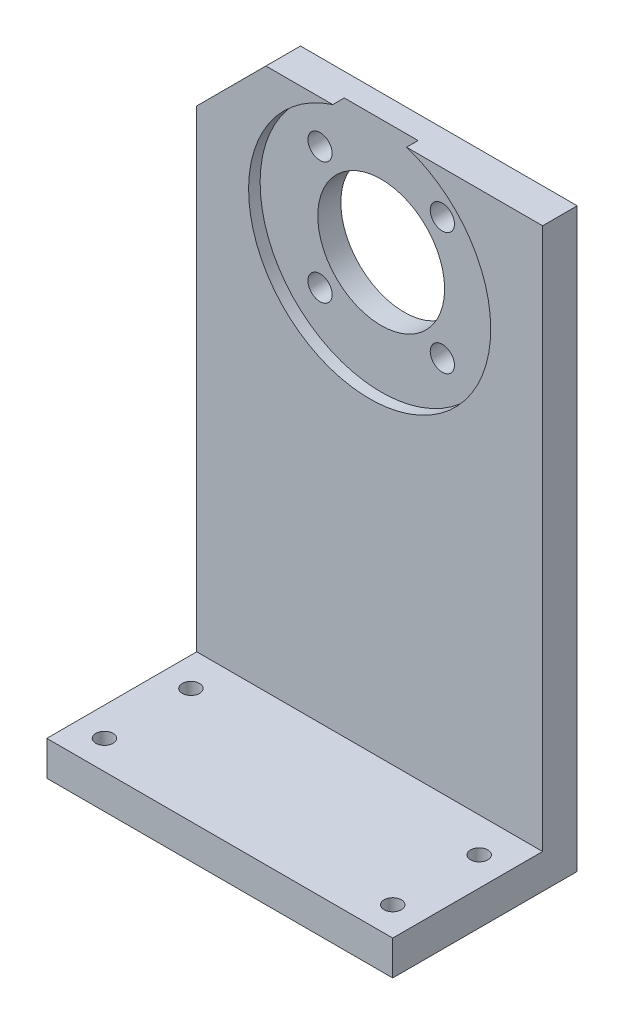
ISO-10303-21;
HEADER;
FILE_DESCRIPTION(('STEP AP214'),'2;1');
FILE_NAME('part.step','',(''),(''),'','','');
FILE_SCHEMA(('AUTOMOTIVE_DESIGN { 1 0 10303 214 1 1 1 1 }'));
ENDSEC;
DATA;
#1=APPLICATION_CONTEXT('core data for automotive mechanical design processes');
#2=APPLICATION_PROTOCOL_DEFINITION('international standard','automotive_design',2000,#1);
#3=PRODUCT_CONTEXT('',#1,'mechanical');
#4=PRODUCT('Part','Part','',(#3));
#5=PRODUCT_RELATED_PRODUCT_CATEGORY('part','',(#4));
#6=PRODUCT_DEFINITION_FORMATION('','',#4);
#7=PRODUCT_DEFINITION_CONTEXT('part definition',#1,'design');
#8=PRODUCT_DEFINITION('design','',#6,#7);
#9=PRODUCT_DEFINITION_SHAPE('','',#8);
#10=(LENGTH_UNIT() NAMED_UNIT(*) SI_UNIT(.MILLI.,.METRE.));
#11=(NAMED_UNIT(*) PLANE_ANGLE_UNIT() SI_UNIT($,.RADIAN.));
#12=(NAMED_UNIT(*) SI_UNIT($,.STERADIAN.) SOLID_ANGLE_UNIT());
#13=UNCERTAINTY_MEASURE_WITH_UNIT(LENGTH_MEASURE(1.E-05),#10,'distance_accuracy_value','');
#14=(GEOMETRIC_REPRESENTATION_CONTEXT(3) GLOBAL_UNCERTAINTY_ASSIGNED_CONTEXT((#13)) GLOBAL_UNIT_ASSIGNED_CONTEXT((#10,
#11,#12)) REPRESENTATION_CONTEXT('',''));
#15=CARTESIAN_POINT('',(0.,0.,0.));
#16=DIRECTION('',(0.,0.,1.));
#17=DIRECTION('',(1.,0.,0.));
#18=AXIS2_PLACEMENT_3D('',#15,#16,#17);
#19=CARTESIAN_POINT('',(211.2030482675,-297.147680018,50.));
#20=DIRECTION('',(0.,1.,0.));
#21=DIRECTION('',(0.,0.,1.));
#22=AXIS2_PLACEMENT_3D('',#19,#20,#21);
#23=CYLINDRICAL_SURFACE('',#22,1.50000000000003);
#24=CARTESIAN_POINT('',(211.2030482675,-292.147680018,50.));
#25=DIRECTION('',(0.,1.,0.));
#26=DIRECTION('',(0.,0.,1.));
#27=AXIS2_PLACEMENT_3D('',#24,#25,#26);
#28=CIRCLE('',#27,1.50000000000003);
#29=CARTESIAN_POINT('',(211.2030482675,-292.147680018,51.5));
#30=VERTEX_POINT('',#29);
#31=EDGE_CURVE('E206',#30,#30,#28,.T.);
#32=ORIENTED_EDGE('',*,*,#31,.F.);
#33=EDGE_LOOP('',(#32));
#34=FACE_BOUND('',#33,.T.);
#35=CARTESIAN_POINT('',(211.2030482675,-286.147680018,50.));
#36=DIRECTION('',(0.,1.,0.));
#37=DIRECTION('',(0.,0.,1.));
#38=AXIS2_PLACEMENT_3D('',#35,#36,#37);
#39=CIRCLE('',#38,1.50000000000003);
#40=CARTESIAN_POINT('',(211.2030482675,-286.147680018,51.5));
#41=VERTEX_POINT('',#40);
#42=EDGE_CURVE('E161',#41,#41,#39,.F.);
#43=ORIENTED_EDGE('',*,*,#42,.F.);
#44=EDGE_LOOP('',(#43));
#45=FACE_BOUND('',#44,.T.);
#46=ADVANCED_FACE('F17',(#34,#45),#23,.F.);
#47=CARTESIAN_POINT('',(211.2030482675,-297.147680018,35.));
#48=DIRECTION('',(0.,1.,0.));
#49=DIRECTION('',(0.,0.,1.));
#50=AXIS2_PLACEMENT_3D('',#47,#48,#49);
#51=CYLINDRICAL_SURFACE('',#50,1.50000000000003);
#52=CARTESIAN_POINT('',(211.2030482675,-292.147680018,35.));
#53=DIRECTION('',(0.,1.,0.));
#54=DIRECTION('',(0.,0.,1.));
#55=AXIS2_PLACEMENT_3D('',#52,#53,#54);
#56=CIRCLE('',#55,1.50000000000003);
#57=CARTESIAN_POINT('',(211.2030482675,-292.147680018,36.5));
#58=VERTEX_POINT('',#57);
#59=EDGE_CURVE('E203',#58,#58,#56,.T.);
#60=ORIENTED_EDGE('',*,*,#59,.F.);
#61=EDGE_LOOP('',(#60));
#62=FACE_BOUND('',#61,.T.);
#63=CARTESIAN_POINT('',(211.2030482675,-286.147680018,35.));
#64=DIRECTION('',(0.,1.,0.));
#65=DIRECTION('',(0.,0.,1.));
#66=AXIS2_PLACEMENT_3D('',#63,#64,#65);
#67=CIRCLE('',#66,1.50000000000003);
#68=CARTESIAN_POINT('',(211.2030482675,-286.147680018,36.5));
#69=VERTEX_POINT('',#68);
#70=EDGE_CURVE('E230',#69,#69,#67,.F.);
#71=ORIENTED_EDGE('',*,*,#70,.F.);
#72=EDGE_LOOP('',(#71));
#73=FACE_BOUND('',#72,.T.);
#74=ADVANCED_FACE('F248',(#62,#73),#51,.F.);
#75=CARTESIAN_POINT('',(261.2030482675,-297.147680018,35.));
#76=DIRECTION('',(0.,1.,0.));
#77=DIRECTION('',(0.,0.,1.));
#78=AXIS2_PLACEMENT_3D('',#75,#76,#77);
#79=CYLINDRICAL_SURFACE('',#78,1.50000000000002);
#80=CARTESIAN_POINT('',(261.2030482675,-292.147680018,35.));
#81=DIRECTION('',(0.,1.,0.));
#82=DIRECTION('',(0.,0.,1.));
#83=AXIS2_PLACEMENT_3D('',#80,#81,#82);
#84=CIRCLE('',#83,1.50000000000002);
#85=CARTESIAN_POINT('',(261.2030482675,-292.147680018,36.5));
#86=VERTEX_POINT('',#85);
#87=EDGE_CURVE('E200',#86,#86,#84,.T.);
#88=ORIENTED_EDGE('',*,*,#87,.F.);
#89=EDGE_LOOP('',(#88));
#90=FACE_BOUND('',#89,.T.);
#91=CARTESIAN_POINT('',(261.2030482675,-286.147680018,35.));
#92=DIRECTION('',(0.,1.,0.));
#93=DIRECTION('',(0.,0.,1.));
#94=AXIS2_PLACEMENT_3D('',#91,#92,#93);
#95=CIRCLE('',#94,1.50000000000002);
#96=CARTESIAN_POINT('',(261.2030482675,-286.147680018,36.5));
#97=VERTEX_POINT('',#96);
#98=EDGE_CURVE('E227',#97,#97,#95,.F.);
#99=ORIENTED_EDGE('',*,*,#98,.F.);
#100=EDGE_LOOP('',(#99));
#101=FACE_BOUND('',#100,.T.);
#102=ADVANCED_FACE('F239',(#90,#101),#79,.F.);
#103=CARTESIAN_POINT('',(261.2030482675,-297.147680018,50.));
#104=DIRECTION('',(0.,1.,0.));
#105=DIRECTION('',(0.,0.,1.));
#106=AXIS2_PLACEMENT_3D('',#103,#104,#105);
#107=CYLINDRICAL_SURFACE('',#106,1.50000000000002);
#108=CARTESIAN_POINT('',(261.2030482675,-292.147680018,50.));
#109=DIRECTION('',(0.,1.,0.));
#110=DIRECTION('',(0.,0.,1.));
#111=AXIS2_PLACEMENT_3D('',#108,#109,#110);
#112=CIRCLE('',#111,1.50000000000002);
#113=CARTESIAN_POINT('',(261.2030482675,-292.147680018,51.5));
#114=VERTEX_POINT('',#113);
#115=EDGE_CURVE('E197',#114,#114,#112,.T.);
#116=ORIENTED_EDGE('',*,*,#115,.F.);
#117=EDGE_LOOP('',(#116));
#118=FACE_BOUND('',#117,.T.);
#119=CARTESIAN_POINT('',(261.2030482675,-286.147680018,50.));
#120=DIRECTION('',(0.,1.,0.));
#121=DIRECTION('',(0.,0.,1.));
#122=AXIS2_PLACEMENT_3D('',#119,#120,#121);
#123=CIRCLE('',#122,1.50000000000002);
#124=CARTESIAN_POINT('',(261.2030482675,-286.147680018,51.5));
#125=VERTEX_POINT('',#124);
#126=EDGE_CURVE('E92',#125,#125,#123,.F.);
#127=ORIENTED_EDGE('',*,*,#126,.F.);
#128=EDGE_LOOP('',(#127));
#129=FACE_BOUND('',#128,.T.);
#130=ADVANCED_FACE('F237',(#118,#129),#107,.F.);
#131=CARTESIAN_POINT('',(236.203136991092,-212.147680018,27.));
#132=DIRECTION('',(0.,0.,1.));
#133=DIRECTION('',(1.,0.,0.));
#134=AXIS2_PLACEMENT_3D('',#131,#132,#133);
#135=CYLINDRICAL_SURFACE('',#134,21.);
#136=CARTESIAN_POINT('',(236.203136991092,-212.147680018,27.));
#137=DIRECTION('',(0.,0.,1.));
#138=DIRECTION('',(1.,0.,0.));
#139=AXIS2_PLACEMENT_3D('',#136,#137,#138);
#140=CIRCLE('',#139,21.);
#141=CARTESIAN_POINT('',(229.800012753659,-192.147680018,27.));
#142=VERTEX_POINT('',#141);
#143=CARTESIAN_POINT('',(242.606261228525,-192.147680018,27.));
#144=VERTEX_POINT('',#143);
#145=EDGE_CURVE('E20',#142,#144,#140,.T.);
#146=ORIENTED_EDGE('',*,*,#145,.F.);
#147=DIRECTION('',(0.,0.,-1.));
#148=VECTOR('',#147,1.);
#149=CARTESIAN_POINT('',(229.800012753659,-192.147680018,18.));
#150=LINE('',#149,#148);
#151=CARTESIAN_POINT('',(229.800012753659,-192.147680018,29.));
#152=VERTEX_POINT('',#151);
#153=EDGE_CURVE('E100',#142,#152,#150,.F.);
#154=ORIENTED_EDGE('',*,*,#153,.T.);
#155=CARTESIAN_POINT('',(236.203136991092,-212.147680018,29.));
#156=DIRECTION('',(0.,0.,1.));
#157=DIRECTION('',(1.,0.,0.));
#158=AXIS2_PLACEMENT_3D('',#155,#156,#157);
#159=CIRCLE('',#158,21.);
#160=CARTESIAN_POINT('',(242.606261228525,-192.147680018,29.));
#161=VERTEX_POINT('',#160);
#162=EDGE_CURVE('E104',#161,#152,#159,.F.);
#163=ORIENTED_EDGE('',*,*,#162,.F.);
#164=DIRECTION('',(0.,0.,-1.));
#165=VECTOR('',#164,1.);
#166=CARTESIAN_POINT('',(242.606261228525,-192.147680018,18.));
#167=LINE('',#166,#165);
#168=EDGE_CURVE('E97',#161,#144,#167,.T.);
#169=ORIENTED_EDGE('',*,*,#168,.T.);
#170=EDGE_LOOP('',(#146,#154,#163,#169));
#171=FACE_BOUND('',#170,.T.);
#172=ADVANCED_FACE('F103',(#171),#135,.F.);
#173=CARTESIAN_POINT('',(236.203136991092,-212.147680018,27.));
#174=DIRECTION('',(0.,0.,1.));
#175=DIRECTION('',(1.,0.,0.));
#176=AXIS2_PLACEMENT_3D('',#173,#174,#175);
#177=PLANE('',#176);
#178=CARTESIAN_POINT('',(236.203136991092,-212.147680018,27.));
#179=DIRECTION('',(0.,0.,1.));
#180=DIRECTION('',(1.,0.,0.));
#181=AXIS2_PLACEMENT_3D('',#178,#179,#180);
#182=CIRCLE('',#181,11.);
#183=CARTESIAN_POINT('',(247.203136991092,-212.147680018,27.));
#184=VERTEX_POINT('',#183);
#185=EDGE_CURVE('E209',#184,#184,#182,.F.);
#186=ORIENTED_EDGE('',*,*,#185,.T.);
#187=EDGE_LOOP('',(#186));
#188=FACE_BOUND('',#187,.T.);
#189=CARTESIAN_POINT('',(246.809738708891,-222.754281735798,27.));
#190=DIRECTION('',(0.,0.,-1.));
#191=DIRECTION('',(-1.,0.,0.));
#192=AXIS2_PLACEMENT_3D('',#189,#190,#191);
#193=CIRCLE('',#192,2.09999999999999);
#194=CARTESIAN_POINT('',(244.709738708891,-222.754281735798,27.));
#195=VERTEX_POINT('',#194);
#196=EDGE_CURVE('E212',#195,#195,#193,.T.);
#197=ORIENTED_EDGE('',*,*,#196,.T.);
#198=EDGE_LOOP('',(#197));
#199=FACE_BOUND('',#198,.T.);
#200=CARTESIAN_POINT('',(225.596535273294,-201.541078300202,27.));
#201=DIRECTION('',(0.,0.,-1.));
#202=DIRECTION('',(-1.,0.,0.));
#203=AXIS2_PLACEMENT_3D('',#200,#201,#202);
#204=CIRCLE('',#203,2.09999999999999);
#205=CARTESIAN_POINT('',(223.496535273294,-201.541078300202,27.));
#206=VERTEX_POINT('',#205);
#207=EDGE_CURVE('E218',#206,#206,#204,.T.);
#208=ORIENTED_EDGE('',*,*,#207,.T.);
#209=EDGE_LOOP('',(#208));
#210=FACE_BOUND('',#209,.T.);
#211=CARTESIAN_POINT('',(225.596535273294,-222.754281735798,27.));
#212=DIRECTION('',(0.,0.,-1.));
#213=DIRECTION('',(-1.,0.,0.));
#214=AXIS2_PLACEMENT_3D('',#211,#212,#213);
#215=CIRCLE('',#214,2.09999999999999);
#216=CARTESIAN_POINT('',(223.496535273294,-222.754281735798,27.));
#217=VERTEX_POINT('',#216);
#218=EDGE_CURVE('E221',#217,#217,#215,.T.);
#219=ORIENTED_EDGE('',*,*,#218,.T.);
#220=EDGE_LOOP('',(#219));
#221=FACE_BOUND('',#220,.T.);
#222=CARTESIAN_POINT('',(246.809738708891,-201.541078300202,27.));
#223=DIRECTION('',(0.,0.,-1.));
#224=DIRECTION('',(-1.,0.,0.));
#225=AXIS2_PLACEMENT_3D('',#222,#223,#224);
#226=CIRCLE('',#225,2.09999999999999);
#227=CARTESIAN_POINT('',(244.709738708891,-201.541078300202,27.));
#228=VERTEX_POINT('',#227);
#229=EDGE_CURVE('E215',#228,#228,#226,.T.);
#230=ORIENTED_EDGE('',*,*,#229,.T.);
#231=EDGE_LOOP('',(#230));
#232=FACE_BOUND('',#231,.T.);
#233=DIRECTION('',(1.,0.,0.));
#234=VECTOR('',#233,1.);
#235=CARTESIAN_POINT('',(219.4648613036,-192.147680018,27.));
#236=LINE('',#235,#234);
#237=EDGE_CURVE('E87',#144,#142,#236,.F.);
#238=ORIENTED_EDGE('',*,*,#237,.T.);
#239=ORIENTED_EDGE('',*,*,#145,.T.);
#240=EDGE_LOOP('',(#238,#239));
#241=FACE_BOUND('',#240,.T.);
#242=ADVANCED_FACE('F86',(#188,#199,#210,#221,#232,#241),#177,.T.);
#243=CARTESIAN_POINT('',(0.,-286.147680018,0.));
#244=DIRECTION('',(0.,1.,0.));
#245=DIRECTION('',(0.,0.,1.));
#246=AXIS2_PLACEMENT_3D('',#243,#244,#245);
#247=PLANE('',#246);
#248=ORIENTED_EDGE('',*,*,#42,.T.);
#249=EDGE_LOOP('',(#248));
#250=FACE_BOUND('',#249,.T.);
#251=ORIENTED_EDGE('',*,*,#98,.T.);
#252=EDGE_LOOP('',(#251));
#253=FACE_BOUND('',#252,.T.);
#254=DIRECTION('',(0.,0.,-1.));
#255=VECTOR('',#254,1.);
#256=CARTESIAN_POINT('',(206.2030482675,-286.147680018,23.));
#257=LINE('',#256,#255);
#258=CARTESIAN_POINT('',(206.2030482675,-286.147680018,29.));
#259=VERTEX_POINT('',#258);
#260=CARTESIAN_POINT('',(206.2030482675,-286.147680018,55.));
#261=VERTEX_POINT('',#260);
#262=EDGE_CURVE('E143',#259,#261,#257,.F.);
#263=ORIENTED_EDGE('',*,*,#262,.T.);
#264=DIRECTION('',(1.,0.,0.));
#265=VECTOR('',#264,1.);
#266=CARTESIAN_POINT('',(0.,-286.147680018,55.));
#267=LINE('',#266,#265);
#268=CARTESIAN_POINT('',(266.2030482675,-286.147680018,55.));
#269=VERTEX_POINT('',#268);
#270=EDGE_CURVE('E152',#269,#261,#267,.F.);
#271=ORIENTED_EDGE('',*,*,#270,.F.);
#272=DIRECTION('',(0.,0.,-1.));
#273=VECTOR('',#272,1.);
#274=CARTESIAN_POINT('',(266.2030482675,-286.147680018,23.));
#275=LINE('',#274,#273);
#276=CARTESIAN_POINT('',(266.2030482675,-286.147680018,29.));
#277=VERTEX_POINT('',#276);
#278=EDGE_CURVE('E155',#277,#269,#275,.F.);
#279=ORIENTED_EDGE('',*,*,#278,.F.);
#280=DIRECTION('',(1.,0.,0.));
#281=VECTOR('',#280,1.);
#282=CARTESIAN_POINT('',(242.8749133092,-286.147680018,29.));
#283=LINE('',#282,#281);
#284=EDGE_CURVE('E150',#259,#277,#283,.T.);
#285=ORIENTED_EDGE('',*,*,#284,.F.);
#286=EDGE_LOOP('',(#263,#271,#279,#285));
#287=FACE_BOUND('',#286,.T.);
#288=ORIENTED_EDGE('',*,*,#70,.T.);
#289=EDGE_LOOP('',(#288));
#290=FACE_BOUND('',#289,.T.);
#291=ORIENTED_EDGE('',*,*,#126,.T.);
#292=EDGE_LOOP('',(#291));
#293=FACE_BOUND('',#292,.T.);
#294=ADVANCED_FACE('F235',(#250,#253,#287,#290,#293),#247,.T.);
#295=CARTESIAN_POINT('',(0.,0.,55.));
#296=DIRECTION('',(0.,0.,1.));
#297=DIRECTION('',(1.,0.,0.));
#298=AXIS2_PLACEMENT_3D('',#295,#296,#297);
#299=PLANE('',#298);
#300=ORIENTED_EDGE('',*,*,#270,.T.);
#301=DIRECTION('',(0.,1.,0.));
#302=VECTOR('',#301,1.);
#303=CARTESIAN_POINT('',(206.2030482675,-292.147680018,55.));
#304=LINE('',#303,#302);
#305=CARTESIAN_POINT('',(206.2030482675,-292.147680018,55.));
#306=VERTEX_POINT('',#305);
#307=EDGE_CURVE('E169',#261,#306,#304,.F.);
#308=ORIENTED_EDGE('',*,*,#307,.T.);
#309=DIRECTION('',(1.,0.,0.));
#310=VECTOR('',#309,1.);
#311=CARTESIAN_POINT('',(207.616141789,-292.147680018,55.));
#312=LINE('',#311,#310);
#313=CARTESIAN_POINT('',(266.2030482675,-292.147680018,55.));
#314=VERTEX_POINT('',#313);
#315=EDGE_CURVE('E110',#314,#306,#312,.F.);
#316=ORIENTED_EDGE('',*,*,#315,.F.);
#317=DIRECTION('',(0.,1.,0.));
#318=VECTOR('',#317,1.);
#319=CARTESIAN_POINT('',(266.2030482675,-292.147680018,55.));
#320=LINE('',#319,#318);
#321=EDGE_CURVE('E157',#269,#314,#320,.F.);
#322=ORIENTED_EDGE('',*,*,#321,.F.);
#323=EDGE_LOOP('',(#300,#308,#316,#322));
#324=FACE_BOUND('',#323,.T.);
#325=ADVANCED_FACE('F301',(#324),#299,.T.);
#326=CARTESIAN_POINT('',(242.8749133092,-210.7827941645,29.));
#327=DIRECTION('',(0.,0.,1.));
#328=DIRECTION('',(1.,0.,0.));
#329=AXIS2_PLACEMENT_3D('',#326,#327,#328);
#330=PLANE('',#329);
#331=DIRECTION('',(1.,0.,0.));
#332=VECTOR('',#331,1.);
#333=CARTESIAN_POINT('',(219.4648613036,-192.147680018,29.));
#334=LINE('',#333,#332);
#335=CARTESIAN_POINT('',(266.20304826748,-192.147680018,29.));
#336=VERTEX_POINT('',#335);
#337=EDGE_CURVE('E105',#336,#161,#334,.F.);
#338=ORIENTED_EDGE('',*,*,#337,.T.);
#339=ORIENTED_EDGE('',*,*,#162,.T.);
#340=DIRECTION('',(1.,0.,0.));
#341=VECTOR('',#340,1.);
#342=CARTESIAN_POINT('',(219.4648613036,-192.147680018,29.));
#343=LINE('',#342,#341);
#344=CARTESIAN_POINT('',(218.203048267498,-192.147680018,29.));
#345=VERTEX_POINT('',#344);
#346=EDGE_CURVE('E113',#152,#345,#343,.F.);
#347=ORIENTED_EDGE('',*,*,#346,.T.);
#348=DIRECTION('',(0.707106781186546,0.707106781186549,0.));
#349=VECTOR('',#348,1.);
#350=CARTESIAN_POINT('',(218.203048267498,-192.147680018,29.));
#351=LINE('',#350,#349);
#352=CARTESIAN_POINT('',(206.2030482675,-204.147680017998,29.));
#353=VERTEX_POINT('',#352);
#354=EDGE_CURVE('E141',#345,#353,#351,.F.);
#355=ORIENTED_EDGE('',*,*,#354,.T.);
#356=DIRECTION('',(0.,1.,0.));
#357=VECTOR('',#356,1.);
#358=CARTESIAN_POINT('',(206.2030482675,-292.147680018,29.));
#359=LINE('',#358,#357);
#360=EDGE_CURVE('E172',#353,#259,#359,.F.);
#361=ORIENTED_EDGE('',*,*,#360,.T.);
#362=ORIENTED_EDGE('',*,*,#284,.T.);
#363=DIRECTION('',(0.,1.,0.));
#364=VECTOR('',#363,1.);
#365=CARTESIAN_POINT('',(266.2030482675,-292.147680018,29.));
#366=LINE('',#365,#364);
#367=EDGE_CURVE('E114',#336,#277,#366,.F.);
#368=ORIENTED_EDGE('',*,*,#367,.F.);
#369=EDGE_LOOP('',(#338,#339,#347,#355,#361,#362,#368));
#370=FACE_BOUND('',#369,.T.);
#371=ADVANCED_FACE('F297',(#370),#330,.T.);
#372=CARTESIAN_POINT('',(225.596535273294,-222.754281735798,33.));
#373=DIRECTION('',(0.,0.,-1.));
#374=DIRECTION('',(-1.,0.,0.));
#375=AXIS2_PLACEMENT_3D('',#372,#373,#374);
#376=CYLINDRICAL_SURFACE('',#375,2.09999999999999);
#377=ORIENTED_EDGE('',*,*,#218,.F.);
#378=EDGE_LOOP('',(#377));
#379=FACE_BOUND('',#378,.T.);
#380=CARTESIAN_POINT('',(225.596535273294,-222.754281735798,23.));
#381=DIRECTION('',(0.,0.,-1.));
#382=DIRECTION('',(-1.,0.,0.));
#383=AXIS2_PLACEMENT_3D('',#380,#381,#382);
#384=CIRCLE('',#383,2.09999999999999);
#385=CARTESIAN_POINT('',(223.496535273294,-222.754281735798,23.));
#386=VERTEX_POINT('',#385);
#387=EDGE_CURVE('E175',#386,#386,#384,.T.);
#388=ORIENTED_EDGE('',*,*,#387,.T.);
#389=EDGE_LOOP('',(#388));
#390=FACE_BOUND('',#389,.T.);
#391=ADVANCED_FACE('F293',(#379,#390),#376,.F.);
#392=CARTESIAN_POINT('',(225.596535273294,-201.541078300202,33.));
#393=DIRECTION('',(0.,0.,-1.));
#394=DIRECTION('',(-1.,0.,0.));
#395=AXIS2_PLACEMENT_3D('',#392,#393,#394);
#396=CYLINDRICAL_SURFACE('',#395,2.09999999999999);
#397=ORIENTED_EDGE('',*,*,#207,.F.);
#398=EDGE_LOOP('',(#397));
#399=FACE_BOUND('',#398,.T.);
#400=CARTESIAN_POINT('',(225.596535273294,-201.541078300202,23.));
#401=DIRECTION('',(0.,0.,-1.));
#402=DIRECTION('',(-1.,0.,0.));
#403=AXIS2_PLACEMENT_3D('',#400,#401,#402);
#404=CIRCLE('',#403,2.09999999999999);
#405=CARTESIAN_POINT('',(223.496535273294,-201.541078300202,23.));
#406=VERTEX_POINT('',#405);
#407=EDGE_CURVE('E192',#406,#406,#404,.T.);
#408=ORIENTED_EDGE('',*,*,#407,.T.);
#409=EDGE_LOOP('',(#408));
#410=FACE_BOUND('',#409,.T.);
#411=ADVANCED_FACE('F289',(#399,#410),#396,.F.);
#412=CARTESIAN_POINT('',(246.809738708891,-201.541078300202,33.));
#413=DIRECTION('',(0.,0.,-1.));
#414=DIRECTION('',(-1.,0.,0.));
#415=AXIS2_PLACEMENT_3D('',#412,#413,#414);
#416=CYLINDRICAL_SURFACE('',#415,2.09999999999999);
#417=ORIENTED_EDGE('',*,*,#229,.F.);
#418=EDGE_LOOP('',(#417));
#419=FACE_BOUND('',#418,.T.);
#420=CARTESIAN_POINT('',(246.809738708891,-201.541078300202,23.));
#421=DIRECTION('',(0.,0.,-1.));
#422=DIRECTION('',(-1.,0.,0.));
#423=AXIS2_PLACEMENT_3D('',#420,#421,#422);
#424=CIRCLE('',#423,2.09999999999999);
#425=CARTESIAN_POINT('',(244.709738708891,-201.541078300202,23.));
#426=VERTEX_POINT('',#425);
#427=EDGE_CURVE('E189',#426,#426,#424,.T.);
#428=ORIENTED_EDGE('',*,*,#427,.T.);
#429=EDGE_LOOP('',(#428));
#430=FACE_BOUND('',#429,.T.);
#431=ADVANCED_FACE('F285',(#419,#430),#416,.F.);
#432=CARTESIAN_POINT('',(246.809738708891,-222.754281735798,33.));
#433=DIRECTION('',(0.,0.,-1.));
#434=DIRECTION('',(-1.,0.,0.));
#435=AXIS2_PLACEMENT_3D('',#432,#433,#434);
#436=CYLINDRICAL_SURFACE('',#435,2.09999999999999);
#437=ORIENTED_EDGE('',*,*,#196,.F.);
#438=EDGE_LOOP('',(#437));
#439=FACE_BOUND('',#438,.T.);
#440=CARTESIAN_POINT('',(246.809738708891,-222.754281735798,23.));
#441=DIRECTION('',(0.,0.,-1.));
#442=DIRECTION('',(-1.,0.,0.));
#443=AXIS2_PLACEMENT_3D('',#440,#441,#442);
#444=CIRCLE('',#443,2.09999999999999);
#445=CARTESIAN_POINT('',(244.709738708891,-222.754281735798,23.));
#446=VERTEX_POINT('',#445);
#447=EDGE_CURVE('E186',#446,#446,#444,.T.);
#448=ORIENTED_EDGE('',*,*,#447,.T.);
#449=EDGE_LOOP('',(#448));
#450=FACE_BOUND('',#449,.T.);
#451=ADVANCED_FACE('F281',(#439,#450),#436,.F.);
#452=CARTESIAN_POINT('',(236.203136991092,-212.147680018,18.));
#453=DIRECTION('',(0.,0.,1.));
#454=DIRECTION('',(1.,0.,0.));
#455=AXIS2_PLACEMENT_3D('',#452,#453,#454);
#456=CYLINDRICAL_SURFACE('',#455,11.);
#457=CARTESIAN_POINT('',(236.203136991092,-212.147680018,23.));
#458=DIRECTION('',(0.,0.,1.));
#459=DIRECTION('',(1.,0.,0.));
#460=AXIS2_PLACEMENT_3D('',#457,#458,#459);
#461=CIRCLE('',#460,11.);
#462=CARTESIAN_POINT('',(247.203136991092,-212.147680018,23.));
#463=VERTEX_POINT('',#462);
#464=EDGE_CURVE('E183',#463,#463,#461,.F.);
#465=ORIENTED_EDGE('',*,*,#464,.T.);
#466=EDGE_LOOP('',(#465));
#467=FACE_BOUND('',#466,.T.);
#468=ORIENTED_EDGE('',*,*,#185,.F.);
#469=EDGE_LOOP('',(#468));
#470=FACE_BOUND('',#469,.T.);
#471=ADVANCED_FACE('F277',(#467,#470),#456,.F.);
#472=CARTESIAN_POINT('',(207.616141789,-292.147680018,23.));
#473=DIRECTION('',(0.,-1.,0.));
#474=DIRECTION('',(0.,0.,-1.));
#475=AXIS2_PLACEMENT_3D('',#472,#473,#474);
#476=PLANE('',#475);
#477=ORIENTED_EDGE('',*,*,#315,.T.);
#478=DIRECTION('',(0.,0.,-1.));
#479=VECTOR('',#478,1.);
#480=CARTESIAN_POINT('',(206.2030482675,-292.147680018,23.));
#481=LINE('',#480,#479);
#482=CARTESIAN_POINT('',(206.2030482675,-292.147680018,23.));
#483=VERTEX_POINT('',#482);
#484=EDGE_CURVE('E180',#306,#483,#481,.T.);
#485=ORIENTED_EDGE('',*,*,#484,.T.);
#486=DIRECTION('',(1.,0.,0.));
#487=VECTOR('',#486,1.);
#488=CARTESIAN_POINT('',(0.,-292.147680018,23.));
#489=LINE('',#488,#487);
#490=CARTESIAN_POINT('',(266.2030482675,-292.147680018,23.));
#491=VERTEX_POINT('',#490);
#492=EDGE_CURVE('E135',#483,#491,#489,.T.);
#493=ORIENTED_EDGE('',*,*,#492,.T.);
#494=DIRECTION('',(0.,0.,-1.));
#495=VECTOR('',#494,1.);
#496=CARTESIAN_POINT('',(266.2030482675,-292.147680018,23.));
#497=LINE('',#496,#495);
#498=EDGE_CURVE('E124',#314,#491,#497,.T.);
#499=ORIENTED_EDGE('',*,*,#498,.F.);
#500=EDGE_LOOP('',(#477,#485,#493,#499));
#501=FACE_BOUND('',#500,.T.);
#502=ORIENTED_EDGE('',*,*,#115,.T.);
#503=EDGE_LOOP('',(#502));
#504=FACE_BOUND('',#503,.T.);
#505=ORIENTED_EDGE('',*,*,#87,.T.);
#506=EDGE_LOOP('',(#505));
#507=FACE_BOUND('',#506,.T.);
#508=ORIENTED_EDGE('',*,*,#59,.T.);
#509=EDGE_LOOP('',(#508));
#510=FACE_BOUND('',#509,.T.);
#511=ORIENTED_EDGE('',*,*,#31,.T.);
#512=EDGE_LOOP('',(#511));
#513=FACE_BOUND('',#512,.T.);
#514=ADVANCED_FACE('F273',(#501,#504,#507,#510,#513),#476,.T.);
#515=CARTESIAN_POINT('',(266.2030482675,-292.147680018,23.));
#516=DIRECTION('',(1.,0.,0.));
#517=DIRECTION('',(0.,0.,-1.));
#518=AXIS2_PLACEMENT_3D('',#515,#516,#517);
#519=PLANE('',#518);
#520=DIRECTION('',(0.,0.,-1.));
#521=VECTOR('',#520,1.);
#522=CARTESIAN_POINT('',(266.203048267471,-192.147680018,18.));
#523=LINE('',#522,#521);
#524=CARTESIAN_POINT('',(266.203048267471,-192.147680018,23.));
#525=VERTEX_POINT('',#524);
#526=EDGE_CURVE('E107',#525,#336,#523,.F.);
#527=ORIENTED_EDGE('',*,*,#526,.T.);
#528=ORIENTED_EDGE('',*,*,#367,.T.);
#529=ORIENTED_EDGE('',*,*,#278,.T.);
#530=ORIENTED_EDGE('',*,*,#321,.T.);
#531=ORIENTED_EDGE('',*,*,#498,.T.);
#532=DIRECTION('',(0.,1.,0.));
#533=VECTOR('',#532,1.);
#534=CARTESIAN_POINT('',(266.2030482675,0.,23.));
#535=LINE('',#534,#533);
#536=EDGE_CURVE('E130',#491,#525,#535,.T.);
#537=ORIENTED_EDGE('',*,*,#536,.T.);
#538=EDGE_LOOP('',(#527,#528,#529,#530,#531,#537));
#539=FACE_BOUND('',#538,.T.);
#540=ADVANCED_FACE('F270',(#539),#519,.T.);
#541=CARTESIAN_POINT('',(219.4648613036,-192.147680018,18.));
#542=DIRECTION('',(0.,-1.,0.));
#543=DIRECTION('',(0.,0.,-1.));
#544=AXIS2_PLACEMENT_3D('',#541,#542,#543);
#545=PLANE('',#544);
#546=ORIENTED_EDGE('',*,*,#168,.F.);
#547=ORIENTED_EDGE('',*,*,#337,.F.);
#548=ORIENTED_EDGE('',*,*,#526,.F.);
#549=DIRECTION('',(1.,0.,0.));
#550=VECTOR('',#549,1.);
#551=CARTESIAN_POINT('',(0.,-192.147680018,23.));
#552=LINE('',#551,#550);
#553=CARTESIAN_POINT('',(218.203048267498,-192.147680018,23.));
#554=VERTEX_POINT('',#553);
#555=EDGE_CURVE('E127',#525,#554,#552,.F.);
#556=ORIENTED_EDGE('',*,*,#555,.T.);
#557=DIRECTION('',(0.,0.,1.));
#558=VECTOR('',#557,1.);
#559=CARTESIAN_POINT('',(218.203048267498,-192.147680018,18.));
#560=LINE('',#559,#558);
#561=EDGE_CURVE('E101',#554,#345,#560,.T.);
#562=ORIENTED_EDGE('',*,*,#561,.T.);
#563=ORIENTED_EDGE('',*,*,#346,.F.);
#564=ORIENTED_EDGE('',*,*,#153,.F.);
#565=ORIENTED_EDGE('',*,*,#237,.F.);
#566=EDGE_LOOP('',(#546,#547,#548,#556,#562,#563,#564,#565));
#567=FACE_BOUND('',#566,.T.);
#568=ADVANCED_FACE('F95',(#567),#545,.F.);
#569=CARTESIAN_POINT('',(218.203048267498,-192.147680018,18.));
#570=DIRECTION('',(0.707106781186549,-0.707106781186546,0.));
#571=DIRECTION('',(0.707106781186546,0.707106781186549,0.));
#572=AXIS2_PLACEMENT_3D('',#569,#570,#571);
#573=PLANE('',#572);
#574=DIRECTION('',(0.,0.,-1.));
#575=VECTOR('',#574,1.);
#576=CARTESIAN_POINT('',(206.2030482675,-204.147680017998,23.));
#577=LINE('',#576,#575);
#578=CARTESIAN_POINT('',(206.2030482675,-204.147680017998,23.));
#579=VERTEX_POINT('',#578);
#580=EDGE_CURVE('E34',#579,#353,#577,.F.);
#581=ORIENTED_EDGE('',*,*,#580,.T.);
#582=ORIENTED_EDGE('',*,*,#354,.F.);
#583=ORIENTED_EDGE('',*,*,#561,.F.);
#584=DIRECTION('',(-0.707106781186545,-0.70710678118655,0.));
#585=VECTOR('',#584,1.);
#586=CARTESIAN_POINT('',(218.203048267498,-192.147680018,23.));
#587=LINE('',#586,#585);
#588=EDGE_CURVE('E26',#554,#579,#587,.T.);
#589=ORIENTED_EDGE('',*,*,#588,.T.);
#590=EDGE_LOOP('',(#581,#582,#583,#589));
#591=FACE_BOUND('',#590,.T.);
#592=ADVANCED_FACE('F260',(#591),#573,.F.);
#593=CARTESIAN_POINT('',(206.2030482675,-292.147680018,23.));
#594=DIRECTION('',(1.,0.,0.));
#595=DIRECTION('',(0.,0.,-1.));
#596=AXIS2_PLACEMENT_3D('',#593,#594,#595);
#597=PLANE('',#596);
#598=ORIENTED_EDGE('',*,*,#580,.F.);
#599=DIRECTION('',(0.,1.,0.));
#600=VECTOR('',#599,1.);
#601=CARTESIAN_POINT('',(206.2030482675,0.,23.));
#602=LINE('',#601,#600);
#603=EDGE_CURVE('E11',#579,#483,#602,.F.);
#604=ORIENTED_EDGE('',*,*,#603,.T.);
#605=ORIENTED_EDGE('',*,*,#484,.F.);
#606=ORIENTED_EDGE('',*,*,#307,.F.);
#607=ORIENTED_EDGE('',*,*,#262,.F.);
#608=ORIENTED_EDGE('',*,*,#360,.F.);
#609=EDGE_LOOP('',(#598,#604,#605,#606,#607,#608));
#610=FACE_BOUND('',#609,.T.);
#611=ADVANCED_FACE('F254',(#610),#597,.F.);
#612=CARTESIAN_POINT('',(0.,0.,23.));
#613=DIRECTION('',(0.,0.,1.));
#614=DIRECTION('',(1.,0.,0.));
#615=AXIS2_PLACEMENT_3D('',#612,#613,#614);
#616=PLANE('',#615);
#617=ORIENTED_EDGE('',*,*,#588,.F.);
#618=ORIENTED_EDGE('',*,*,#555,.F.);
#619=ORIENTED_EDGE('',*,*,#536,.F.);
#620=ORIENTED_EDGE('',*,*,#492,.F.);
#621=ORIENTED_EDGE('',*,*,#603,.F.);
#622=EDGE_LOOP('',(#617,#618,#619,#620,#621));
#623=FACE_BOUND('',#622,.T.);
#624=ORIENTED_EDGE('',*,*,#464,.F.);
#625=EDGE_LOOP('',(#624));
#626=FACE_BOUND('',#625,.T.);
#627=ORIENTED_EDGE('',*,*,#447,.F.);
#628=EDGE_LOOP('',(#627));
#629=FACE_BOUND('',#628,.T.);
#630=ORIENTED_EDGE('',*,*,#427,.F.);
#631=EDGE_LOOP('',(#630));
#632=FACE_BOUND('',#631,.T.);
#633=ORIENTED_EDGE('',*,*,#407,.F.);
#634=EDGE_LOOP('',(#633));
#635=FACE_BOUND('',#634,.T.);
#636=ORIENTED_EDGE('',*,*,#387,.F.);
#637=EDGE_LOOP('',(#636));
#638=FACE_BOUND('',#637,.T.);
#639=ADVANCED_FACE('F252',(#623,#626,#629,#632,#635,#638),#616,.F.);
#640=CLOSED_SHELL('',(#46,#74,#102,#130,#172,#242,#294,#325,#371,#391,#411,#431,#451,#471,#514,
#540,#568,#592,#611,#639));
#641=MANIFOLD_SOLID_BREP('B1',#640);
#642=ADVANCED_BREP_SHAPE_REPRESENTATION('',(#18,#641),#14);
#643=SHAPE_DEFINITION_REPRESENTATION(#9,#642);
ENDSEC;
END-ISO-10303-21;
